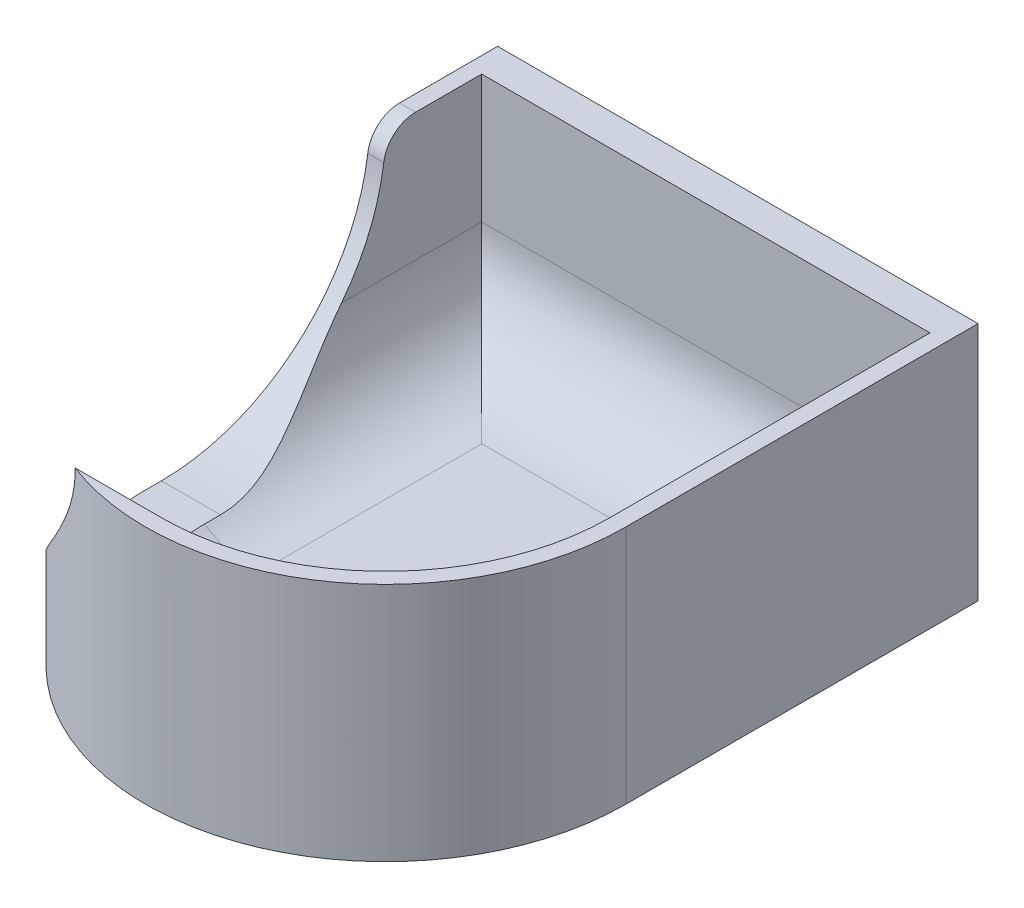
ISO-10303-21;
HEADER;
FILE_DESCRIPTION(('STEP AP214'),'2;1');
FILE_NAME('part.step','',(''),(''),'','','');
FILE_SCHEMA(('AUTOMOTIVE_DESIGN { 1 0 10303 214 1 1 1 1 }'));
ENDSEC;
DATA;
#1=APPLICATION_CONTEXT('core data for automotive mechanical design processes');
#2=APPLICATION_PROTOCOL_DEFINITION('international standard','automotive_design',2000,#1);
#3=PRODUCT_CONTEXT('',#1,'mechanical');
#4=PRODUCT('Part','Part','',(#3));
#5=PRODUCT_RELATED_PRODUCT_CATEGORY('part','',(#4));
#6=PRODUCT_DEFINITION_FORMATION('','',#4);
#7=PRODUCT_DEFINITION_CONTEXT('part definition',#1,'design');
#8=PRODUCT_DEFINITION('design','',#6,#7);
#9=PRODUCT_DEFINITION_SHAPE('','',#8);
#10=(LENGTH_UNIT() NAMED_UNIT(*) SI_UNIT(.MILLI.,.METRE.));
#11=(NAMED_UNIT(*) PLANE_ANGLE_UNIT() SI_UNIT($,.RADIAN.));
#12=(NAMED_UNIT(*) SI_UNIT($,.STERADIAN.) SOLID_ANGLE_UNIT());
#13=UNCERTAINTY_MEASURE_WITH_UNIT(LENGTH_MEASURE(1.E-05),#10,'distance_accuracy_value','');
#14=(GEOMETRIC_REPRESENTATION_CONTEXT(3) GLOBAL_UNCERTAINTY_ASSIGNED_CONTEXT((#13)) GLOBAL_UNIT_ASSIGNED_CONTEXT((#10,
#11,#12)) REPRESENTATION_CONTEXT('',''));
#15=CARTESIAN_POINT('',(0.,0.,0.));
#16=DIRECTION('',(0.,0.,1.));
#17=DIRECTION('',(1.,0.,0.));
#18=AXIS2_PLACEMENT_3D('',#15,#16,#17);
#19=CARTESIAN_POINT('',(0.,1.27,0.));
#20=DIRECTION('',(1.,0.,0.));
#21=DIRECTION('',(0.,0.,-1.));
#22=AXIS2_PLACEMENT_3D('',#19,#20,#21);
#23=PLANE('',#22);
#24=CARTESIAN_POINT('',(0.,19.05,24.13));
#25=DIRECTION('',(-1.,0.,0.));
#26=DIRECTION('',(0.,0.,1.));
#27=AXIS2_PLACEMENT_3D('',#24,#25,#26);
#28=CIRCLE('',#27,16.51);
#29=CARTESIAN_POINT('',(0.,16.8486666666667,7.76741366545142));
#30=VERTEX_POINT('',#29);
#31=CARTESIAN_POINT('',(0.,2.53999999999999,24.13));
#32=VERTEX_POINT('',#31);
#33=EDGE_CURVE('E370',#30,#32,#28,.T.);
#34=ORIENTED_EDGE('',*,*,#33,.F.);
#35=CARTESIAN_POINT('',(0.,16.51,5.25009269090549));
#36=DIRECTION('',(1.,0.,0.));
#37=DIRECTION('',(0.,0.,-1.));
#38=AXIS2_PLACEMENT_3D('',#35,#36,#37);
#39=CIRCLE('',#38,2.54);
#40=CARTESIAN_POINT('',(0.,19.05,5.25009269090549));
#41=VERTEX_POINT('',#40);
#42=EDGE_CURVE('E11',#30,#41,#39,.F.);
#43=ORIENTED_EDGE('',*,*,#42,.T.);
#44=DIRECTION('',(0.,0.,1.));
#45=VECTOR('',#44,1.);
#46=CARTESIAN_POINT('',(0.,19.05,0.));
#47=LINE('',#46,#45);
#48=CARTESIAN_POINT('',(0.,19.05,-2.54));
#49=VERTEX_POINT('',#48);
#50=EDGE_CURVE('E169',#49,#41,#47,.T.);
#51=ORIENTED_EDGE('',*,*,#50,.F.);
#52=DIRECTION('',(0.,1.,0.));
#53=VECTOR('',#52,1.);
#54=CARTESIAN_POINT('',(0.,19.05,-2.54));
#55=LINE('',#54,#53);
#56=CARTESIAN_POINT('',(0.,0.,-2.54));
#57=VERTEX_POINT('',#56);
#58=EDGE_CURVE('E256',#57,#49,#55,.T.);
#59=ORIENTED_EDGE('',*,*,#58,.F.);
#60=DIRECTION('',(0.,0.,1.));
#61=VECTOR('',#60,1.);
#62=CARTESIAN_POINT('',(0.,0.,0.));
#63=LINE('',#62,#61);
#64=CARTESIAN_POINT('',(0.,0.,25.4));
#65=VERTEX_POINT('',#64);
#66=EDGE_CURVE('E184',#57,#65,#63,.T.);
#67=ORIENTED_EDGE('',*,*,#66,.T.);
#68=DIRECTION('',(0.,-1.,0.));
#69=VECTOR('',#68,1.);
#70=CARTESIAN_POINT('',(0.,1.27,25.4));
#71=LINE('',#70,#69);
#72=CARTESIAN_POINT('',(0.,2.53999999999999,25.4));
#73=VERTEX_POINT('',#72);
#74=EDGE_CURVE('E192',#73,#65,#71,.T.);
#75=ORIENTED_EDGE('',*,*,#74,.F.);
#76=DIRECTION('',(0.,0.,1.));
#77=VECTOR('',#76,1.);
#78=CARTESIAN_POINT('',(0.,2.53999999999999,24.13));
#79=LINE('',#78,#77);
#80=EDGE_CURVE('E371',#32,#73,#79,.T.);
#81=ORIENTED_EDGE('',*,*,#80,.F.);
#82=EDGE_LOOP('',(#34,#43,#51,#59,#67,#75,#81));
#83=FACE_BOUND('',#82,.T.);
#84=ADVANCED_FACE('F33',(#83),#23,.F.);
#85=CARTESIAN_POINT('',(19.05,1.27,25.4));
#86=DIRECTION('',(0.,-1.,0.));
#87=DIRECTION('',(0.,0.,-1.));
#88=AXIS2_PLACEMENT_3D('',#85,#86,#87);
#89=CYLINDRICAL_SURFACE('',#88,19.05);
#90=CARTESIAN_POINT('',(0.0423804751883763,2.53999999999999,26.67));
#91=CARTESIAN_POINT('',(0.0556551029180689,2.539997343718,26.868723074491));
#92=CARTESIAN_POINT('',(0.0720511813743714,2.54358885050869,27.0672053878828));
#93=CARTESIAN_POINT('',(0.111021359827417,2.55787912838895,27.4632921775987));
#94=CARTESIAN_POINT('',(0.133595024486384,2.56857739873693,27.6608967147832));
#95=CARTESIAN_POINT('',(0.210430301954301,2.61117924349988,28.2513935083383));
#96=CARTESIAN_POINT('',(0.273836675767801,2.65359023105209,28.6424223614394));
#97=CARTESIAN_POINT('',(0.423305751570554,2.76478825043021,29.4126623917759));
#98=CARTESIAN_POINT('',(0.509169859931028,2.83334638492809,29.7919460782634));
#99=CARTESIAN_POINT('',(0.702362085916339,2.9953307867168,30.5396290604992));
#100=CARTESIAN_POINT('',(0.809694049303724,3.08876151069003,30.9080263924694));
#101=CARTESIAN_POINT('',(1.04366998107699,3.29832656471585,31.6304310171624));
#102=CARTESIAN_POINT('',(1.1702456452415,3.41438098920775,31.9844838070084));
#103=CARTESIAN_POINT('',(1.44111377925414,3.66750416048797,32.6779254389082));
#104=CARTESIAN_POINT('',(1.58540541126723,3.80457191357652,33.0173149734007));
#105=CARTESIAN_POINT('',(1.89014286455748,4.09815925358456,33.6810290739423));
#106=CARTESIAN_POINT('',(2.05062266550293,4.25471992531914,34.0053197717281));
#107=CARTESIAN_POINT('',(2.38562465049262,4.58527436726568,34.63737495908));
#108=CARTESIAN_POINT('',(2.56015005318496,4.75927213556355,34.9451356335798));
#109=CARTESIAN_POINT('',(3.00050158087159,5.20262815039843,35.6746563179186));
#110=CARTESIAN_POINT('',(3.27286885905098,5.48040451355319,36.087389638051));
#111=CARTESIAN_POINT('',(3.83782201503168,6.06413243501636,36.8772831521421));
#112=CARTESIAN_POINT('',(4.1304075120419,6.37008346271761,37.2544440157581));
#113=CARTESIAN_POINT('',(4.73176383540349,7.00731530409966,37.974214895681));
#114=CARTESIAN_POINT('',(5.04056133971244,7.33863830776129,38.3167650655728));
#115=CARTESIAN_POINT('',(5.66946842596214,8.02355775221394,38.9671834806088));
#116=CARTESIAN_POINT('',(5.98957618311975,8.37715060715146,39.2750572871344));
#117=CARTESIAN_POINT('',(6.64477461905551,9.11408194153044,39.8641527562994));
#118=CARTESIAN_POINT('',(6.98004008055035,9.49793942781883,40.1445282346122));
#119=CARTESIAN_POINT('',(7.65292722302761,10.2871127527016,40.6706075520662));
#120=CARTESIAN_POINT('',(7.99054967414581,10.6924359202691,40.9162994429539));
#121=CARTESIAN_POINT('',(8.49374978961491,11.3172035840868,41.2590478554189));
#122=CARTESIAN_POINT('',(8.66099098488786,11.5283185869105,41.3690264887104));
#123=CARTESIAN_POINT('',(8.99330911197168,11.9564718050915,41.5803647261186));
#124=CARTESIAN_POINT('',(9.15838624792917,12.1735094556958,41.6817251482559));
#125=CARTESIAN_POINT('',(9.48499606915872,12.6138432219316,41.8757171870623));
#126=CARTESIAN_POINT('',(9.64653076382745,12.8371356168773,41.9683538558357));
#127=CARTESIAN_POINT('',(9.96447524973992,13.290705538023,42.144813231693));
#128=CARTESIAN_POINT('',(10.1208859529102,13.5209818070862,42.2286375130654));
#129=CARTESIAN_POINT('',(10.4102363410239,13.964567852795,42.3788301093524));
#130=CARTESIAN_POINT('',(10.5439071855732,14.1770908724114,42.4461069282376));
#131=CARTESIAN_POINT('',(10.8033562577825,14.6091193977409,42.5731247682412));
#132=CARTESIAN_POINT('',(10.9291349238425,14.8286245145854,42.6328662081264));
#133=CARTESIAN_POINT('',(11.1691695253017,15.273672456814,42.7439430806485));
#134=CARTESIAN_POINT('',(11.2835068793378,15.4991556289124,42.7953398154261));
#135=CARTESIAN_POINT('',(11.498315641895,15.9584670231985,42.8896632479067));
#136=CARTESIAN_POINT('',(11.5987864786133,16.1922955890185,42.9325895963543));
#137=CARTESIAN_POINT('',(11.7689442324577,16.6358286177001,43.0038646754241));
#138=CARTESIAN_POINT('',(11.8409638530378,16.8444363931379,43.0334057624827));
#139=CARTESIAN_POINT('',(11.9681651684859,17.2674984981419,43.0848757169496));
#140=CARTESIAN_POINT('',(12.0233626141694,17.481947152551,43.1068117077708));
#141=CARTESIAN_POINT('',(12.1146771509398,17.9200758679871,43.1427816491988));
#142=CARTESIAN_POINT('',(12.150399709167,18.1438544566717,43.1566525596305));
#143=CARTESIAN_POINT('',(12.1864817242824,18.4820048081312,43.1706153137696));
#144=CARTESIAN_POINT('',(12.195592650614,18.5953540346697,43.1741290884134));
#145=CARTESIAN_POINT('',(12.2077807577258,18.8224598934582,43.17882325116));
#146=CARTESIAN_POINT('',(12.2108560021738,18.9362166447261,43.1800028904402));
#147=CARTESIAN_POINT('',(12.2108406949392,19.05,43.18));
#148=B_SPLINE_CURVE_WITH_KNOTS('',3,(#90,#91,#92,#93,#94,#95,#96,#97,#98,#99,#100,#101,#102,
#103,#104,#105,#106,#107,#108,#109,#110,#111,#112,#113,#114,#115,#116,#117,#118,#119,#120,#121,
#122,#123,#124,#125,#126,#127,#128,#129,#130,#131,#132,#133,#134,#135,#136,#137,#138,#139,#140,
#141,#142,#143,#144,#145,#146,#147),.UNSPECIFIED.,.F.,.F.,(4,2,2,2,2,2,2,2,2,2,2,2,2,2,2,2,2,2,
2,2,2,2,2,2,2,2,2,2,4),(0.,0.597378441710434,1.19471479668098,2.388029717813,3.57112938842866,
4.7544411902553,5.93364694788354,7.11279695921495,8.29447570247735,9.476426011002,
11.1754345355077,12.8744110695065,14.5762768109188,16.277869217949,18.0214928126942,
19.7657156153694,20.6383197762293,21.510841018849,22.382853818505,23.2547105718267,
24.0342101807137,24.8136664510397,25.5871086248445,26.3605826829546,27.0278402960792,
27.6944712142999,28.3741478024441,28.7152906512354,29.0565429255916),.UNSPECIFIED.);
#149=CARTESIAN_POINT('',(0.0423804751883763,2.53999999999999,26.67));
#150=VERTEX_POINT('',#149);
#151=CARTESIAN_POINT('',(12.2108406949392,19.05,43.18));
#152=VERTEX_POINT('',#151);
#153=EDGE_CURVE('E142',#150,#152,#148,.T.);
#154=ORIENTED_EDGE('',*,*,#153,.F.);
#155=CARTESIAN_POINT('',(19.05,2.53999999999999,25.4));
#156=DIRECTION('',(0.,-1.,0.));
#157=DIRECTION('',(0.,0.,-1.));
#158=AXIS2_PLACEMENT_3D('',#155,#156,#157);
#159=CIRCLE('',#158,19.05);
#160=EDGE_CURVE('E153',#73,#150,#159,.F.);
#161=ORIENTED_EDGE('',*,*,#160,.F.);
#162=ORIENTED_EDGE('',*,*,#74,.T.);
#163=CARTESIAN_POINT('',(19.05,0.,25.4));
#164=DIRECTION('',(0.,1.,0.));
#165=DIRECTION('',(0.,0.,1.));
#166=AXIS2_PLACEMENT_3D('',#163,#164,#165);
#167=CIRCLE('',#166,19.05);
#168=CARTESIAN_POINT('',(38.1,0.,25.4));
#169=VERTEX_POINT('',#168);
#170=EDGE_CURVE('E187',#65,#169,#167,.T.);
#171=ORIENTED_EDGE('',*,*,#170,.T.);
#172=DIRECTION('',(0.,-1.,0.));
#173=VECTOR('',#172,1.);
#174=CARTESIAN_POINT('',(38.1,1.27,25.4));
#175=LINE('',#174,#173);
#176=CARTESIAN_POINT('',(38.1,19.05,25.4));
#177=VERTEX_POINT('',#176);
#178=EDGE_CURVE('E166',#177,#169,#175,.T.);
#179=ORIENTED_EDGE('',*,*,#178,.F.);
#180=CARTESIAN_POINT('',(19.05,19.05,25.4));
#181=DIRECTION('',(0.,1.,0.));
#182=DIRECTION('',(0.,0.,1.));
#183=AXIS2_PLACEMENT_3D('',#180,#181,#182);
#184=CIRCLE('',#183,19.05);
#185=EDGE_CURVE('E159',#152,#177,#184,.T.);
#186=ORIENTED_EDGE('',*,*,#185,.F.);
#187=EDGE_LOOP('',(#154,#161,#162,#171,#179,#186));
#188=FACE_BOUND('',#187,.T.);
#189=ADVANCED_FACE('F164',(#188),#89,.T.);
#190=CARTESIAN_POINT('',(38.1,1.27,0.));
#191=DIRECTION('',(-1.,0.,0.));
#192=DIRECTION('',(0.,0.,1.));
#193=AXIS2_PLACEMENT_3D('',#190,#191,#192);
#194=PLANE('',#193);
#195=DIRECTION('',(0.,0.,-1.));
#196=VECTOR('',#195,1.);
#197=CARTESIAN_POINT('',(38.1,0.,0.));
#198=LINE('',#197,#196);
#199=CARTESIAN_POINT('',(38.1,0.,-2.54));
#200=VERTEX_POINT('',#199);
#201=EDGE_CURVE('E189',#169,#200,#198,.T.);
#202=ORIENTED_EDGE('',*,*,#201,.T.);
#203=DIRECTION('',(0.,-1.,0.));
#204=VECTOR('',#203,1.);
#205=CARTESIAN_POINT('',(38.1,19.05,-2.54));
#206=LINE('',#205,#204);
#207=CARTESIAN_POINT('',(38.1,19.05,-2.54));
#208=VERTEX_POINT('',#207);
#209=EDGE_CURVE('E245',#208,#200,#206,.T.);
#210=ORIENTED_EDGE('',*,*,#209,.F.);
#211=DIRECTION('',(0.,0.,-1.));
#212=VECTOR('',#211,1.);
#213=CARTESIAN_POINT('',(38.1,19.05,25.4));
#214=LINE('',#213,#212);
#215=EDGE_CURVE('E168',#177,#208,#214,.T.);
#216=ORIENTED_EDGE('',*,*,#215,.F.);
#217=ORIENTED_EDGE('',*,*,#178,.T.);
#218=EDGE_LOOP('',(#202,#210,#216,#217));
#219=FACE_BOUND('',#218,.T.);
#220=ADVANCED_FACE('F329',(#219),#194,.F.);
#221=CARTESIAN_POINT('',(19.05,1.27,25.4));
#222=DIRECTION('',(0.,1.,0.));
#223=DIRECTION('',(0.,0.,1.));
#224=AXIS2_PLACEMENT_3D('',#221,#222,#223);
#225=PLANE('',#224);
#226=DIRECTION('',(0.,0.,1.));
#227=VECTOR('',#226,1.);
#228=CARTESIAN_POINT('',(29.21,1.27,25.4));
#229=LINE('',#228,#227);
#230=CARTESIAN_POINT('',(29.21,1.27,25.4));
#231=VERTEX_POINT('',#230);
#232=CARTESIAN_POINT('',(29.21,1.27,7.62));
#233=VERTEX_POINT('',#232);
#234=EDGE_CURVE('E360',#231,#233,#229,.F.);
#235=ORIENTED_EDGE('',*,*,#234,.T.);
#236=DIRECTION('',(-1.,0.,0.));
#237=VECTOR('',#236,1.);
#238=CARTESIAN_POINT('',(19.05,1.27,7.62));
#239=LINE('',#238,#237);
#240=CARTESIAN_POINT('',(8.89,1.27,7.62));
#241=VERTEX_POINT('',#240);
#242=EDGE_CURVE('E361',#233,#241,#239,.T.);
#243=ORIENTED_EDGE('',*,*,#242,.T.);
#244=DIRECTION('',(0.,0.,-1.));
#245=VECTOR('',#244,1.);
#246=CARTESIAN_POINT('',(8.89,1.27,25.4));
#247=LINE('',#246,#245);
#248=CARTESIAN_POINT('',(8.89,1.27,25.4));
#249=VERTEX_POINT('',#248);
#250=EDGE_CURVE('E194',#241,#249,#247,.F.);
#251=ORIENTED_EDGE('',*,*,#250,.T.);
#252=CARTESIAN_POINT('',(19.05,1.27,25.4));
#253=DIRECTION('',(0.,1.,0.));
#254=DIRECTION('',(0.,0.,1.));
#255=AXIS2_PLACEMENT_3D('',#252,#253,#254);
#256=CIRCLE('',#255,10.16);
#257=EDGE_CURVE('E358',#249,#231,#256,.T.);
#258=ORIENTED_EDGE('',*,*,#257,.T.);
#259=EDGE_LOOP('',(#235,#243,#251,#258));
#260=FACE_BOUND('',#259,.T.);
#261=ADVANCED_FACE('F326',(#260),#225,.T.);
#262=CARTESIAN_POINT('',(19.05,0.,25.4));
#263=DIRECTION('',(0.,1.,0.));
#264=DIRECTION('',(0.,0.,1.));
#265=AXIS2_PLACEMENT_3D('',#262,#263,#264);
#266=PLANE('',#265);
#267=ORIENTED_EDGE('',*,*,#66,.F.);
#268=DIRECTION('',(-1.,0.,0.));
#269=VECTOR('',#268,1.);
#270=CARTESIAN_POINT('',(38.1,0.,-2.54));
#271=LINE('',#270,#269);
#272=EDGE_CURVE('E249',#200,#57,#271,.T.);
#273=ORIENTED_EDGE('',*,*,#272,.F.);
#274=ORIENTED_EDGE('',*,*,#201,.F.);
#275=ORIENTED_EDGE('',*,*,#170,.F.);
#276=EDGE_LOOP('',(#267,#273,#274,#275));
#277=FACE_BOUND('',#276,.T.);
#278=ADVANCED_FACE('F324',(#277),#266,.F.);
#279=CARTESIAN_POINT('',(36.83,19.05,0.));
#280=DIRECTION('',(1.,0.,0.));
#281=DIRECTION('',(0.,0.,-1.));
#282=AXIS2_PLACEMENT_3D('',#279,#280,#281);
#283=PLANE('',#282);
#284=DIRECTION('',(0.,-1.,0.));
#285=VECTOR('',#284,1.);
#286=CARTESIAN_POINT('',(36.83,19.05,0.));
#287=LINE('',#286,#285);
#288=CARTESIAN_POINT('',(36.83,19.05,0.));
#289=VERTEX_POINT('',#288);
#290=CARTESIAN_POINT('',(36.83,8.89,0.));
#291=VERTEX_POINT('',#290);
#292=EDGE_CURVE('E182',#289,#291,#287,.T.);
#293=ORIENTED_EDGE('',*,*,#292,.T.);
#294=DIRECTION('',(0.,0.,1.));
#295=VECTOR('',#294,1.);
#296=CARTESIAN_POINT('',(36.83,8.89,0.));
#297=LINE('',#296,#295);
#298=CARTESIAN_POINT('',(36.83,8.89,25.4));
#299=VERTEX_POINT('',#298);
#300=EDGE_CURVE('E224',#291,#299,#297,.T.);
#301=ORIENTED_EDGE('',*,*,#300,.T.);
#302=DIRECTION('',(0.,-1.,0.));
#303=VECTOR('',#302,1.);
#304=CARTESIAN_POINT('',(36.83,19.05,25.4));
#305=LINE('',#304,#303);
#306=CARTESIAN_POINT('',(36.83,19.05,25.4));
#307=VERTEX_POINT('',#306);
#308=EDGE_CURVE('E179',#307,#299,#305,.T.);
#309=ORIENTED_EDGE('',*,*,#308,.F.);
#310=DIRECTION('',(0.,0.,1.));
#311=VECTOR('',#310,1.);
#312=CARTESIAN_POINT('',(36.83,19.05,0.));
#313=LINE('',#312,#311);
#314=EDGE_CURVE('E171',#289,#307,#313,.T.);
#315=ORIENTED_EDGE('',*,*,#314,.F.);
#316=EDGE_LOOP('',(#293,#301,#309,#315));
#317=FACE_BOUND('',#316,.T.);
#318=ADVANCED_FACE('F320',(#317),#283,.F.);
#319=CARTESIAN_POINT('',(19.05,19.05,25.4));
#320=DIRECTION('',(0.,-1.,0.));
#321=DIRECTION('',(0.,0.,-1.));
#322=AXIS2_PLACEMENT_3D('',#319,#320,#321);
#323=CYLINDRICAL_SURFACE('',#322,17.78);
#324=CARTESIAN_POINT('',(19.05,8.89,25.4));
#325=DIRECTION('',(0.,1.,0.));
#326=DIRECTION('',(0.,0.,1.));
#327=AXIS2_PLACEMENT_3D('',#324,#325,#326);
#328=CIRCLE('',#327,17.78);
#329=CARTESIAN_POINT('',(8.46196967235325,8.89,39.6836274727687));
#330=VERTEX_POINT('',#329);
#331=EDGE_CURVE('E219',#299,#330,#328,.F.);
#332=ORIENTED_EDGE('',*,*,#331,.T.);
#333=CARTESIAN_POINT('',(8.46196967235325,8.89,39.6836274727687));
#334=CARTESIAN_POINT('',(8.68530876541504,9.1020547441119,39.849172674323));
#335=CARTESIAN_POINT('',(8.91095064161583,9.31658307025659,40.0083281410843));
#336=CARTESIAN_POINT('',(9.36635673715928,9.75006889500698,40.3141117517929));
#337=CARTESIAN_POINT('',(9.5961203476241,9.96902574001477,40.4607417279102));
#338=CARTESIAN_POINT('',(10.2905953093621,10.6315007608812,40.8820650563732));
#339=CARTESIAN_POINT('',(10.7608519798848,11.0809665532606,41.1384575508911));
#340=CARTESIAN_POINT('',(11.7117945706679,11.9912133524205,41.6036686284633));
#341=CARTESIAN_POINT('',(12.1924609454968,12.4519733368379,41.8125691163161));
#342=CARTESIAN_POINT('',(13.1624156400652,13.382759453983,42.1849523146268));
#343=CARTESIAN_POINT('',(13.6517048595649,13.8527865543128,42.348430255221));
#344=CARTESIAN_POINT('',(14.5461024573266,14.7126271342244,42.6051792341021));
#345=CARTESIAN_POINT('',(14.9501793819951,15.1013298772043,42.7058289078576));
#346=CARTESIAN_POINT('',(15.7613678233381,15.8820004362566,42.8781381650228));
#347=CARTESIAN_POINT('',(16.1684798946605,16.273968850722,42.9497923105826));
#348=CARTESIAN_POINT('',(17.3920195128562,17.4523319331716,43.1216616105605));
#349=CARTESIAN_POINT('',(18.2117843342853,18.2422751884191,43.1791053011577));
#350=CARTESIAN_POINT('',(19.0371977835555,19.0376634756445,43.1799965412986));
#351=CARTESIAN_POINT('',(19.0435989160056,19.043831761217,43.1799999980066));
#352=CARTESIAN_POINT('',(19.05,19.05,43.18));
#353=B_SPLINE_CURVE_WITH_KNOTS('',3,(#333,#334,#335,#336,#337,#338,#339,#340,#341,#342,#343,
#344,#345,#346,#347,#348,#349,#350,#351,#352),.UNSPECIFIED.,.F.,.F.,(4,2,2,2,2,2,2,2,2,4),(0.,
1.04876968974704,2.09738570674164,4.19292847807109,6.28482938411923,8.37694987966886,
10.0850967706223,11.7935638608301,15.2057002548419,15.2323685901395),.UNSPECIFIED.);
#354=CARTESIAN_POINT('',(19.05,19.05,43.18));
#355=VERTEX_POINT('',#354);
#356=EDGE_CURVE('E262',#355,#330,#353,.F.);
#357=ORIENTED_EDGE('',*,*,#356,.F.);
#358=CARTESIAN_POINT('',(19.05,19.05,25.4));
#359=DIRECTION('',(0.,-1.,0.));
#360=DIRECTION('',(0.,0.,1.));
#361=AXIS2_PLACEMENT_3D('',#358,#359,#360);
#362=CIRCLE('',#361,17.78);
#363=EDGE_CURVE('E162',#307,#355,#362,.T.);
#364=ORIENTED_EDGE('',*,*,#363,.F.);
#365=ORIENTED_EDGE('',*,*,#308,.T.);
#366=EDGE_LOOP('',(#332,#357,#364,#365));
#367=FACE_BOUND('',#366,.T.);
#368=ADVANCED_FACE('F317',(#367),#323,.F.);
#369=CARTESIAN_POINT('',(1.27,19.05,0.));
#370=DIRECTION('',(-1.,0.,0.));
#371=DIRECTION('',(0.,0.,1.));
#372=AXIS2_PLACEMENT_3D('',#369,#370,#371);
#373=PLANE('',#372);
#374=DIRECTION('',(0.,0.,-1.));
#375=VECTOR('',#374,1.);
#376=CARTESIAN_POINT('',(1.27,19.05,0.));
#377=LINE('',#376,#375);
#378=CARTESIAN_POINT('',(1.27,19.05,5.25009269090549));
#379=VERTEX_POINT('',#378);
#380=CARTESIAN_POINT('',(1.27000000000003,19.05,0.));
#381=VERTEX_POINT('',#380);
#382=EDGE_CURVE('E178',#379,#381,#377,.T.);
#383=ORIENTED_EDGE('',*,*,#382,.F.);
#384=CARTESIAN_POINT('',(1.27,16.51,5.25009269090549));
#385=DIRECTION('',(-1.,0.,0.));
#386=DIRECTION('',(0.,0.,1.));
#387=AXIS2_PLACEMENT_3D('',#384,#385,#386);
#388=CIRCLE('',#387,2.54);
#389=CARTESIAN_POINT('',(1.27,16.8486666666667,7.76741366545142));
#390=VERTEX_POINT('',#389);
#391=EDGE_CURVE('E55',#379,#390,#388,.F.);
#392=ORIENTED_EDGE('',*,*,#391,.T.);
#393=CARTESIAN_POINT('',(1.27,19.05,24.13));
#394=DIRECTION('',(-1.,0.,0.));
#395=DIRECTION('',(0.,0.,1.));
#396=AXIS2_PLACEMENT_3D('',#393,#394,#395);
#397=CIRCLE('',#396,16.51);
#398=CARTESIAN_POINT('',(1.27,8.89,11.1163725272313));
#399=VERTEX_POINT('',#398);
#400=EDGE_CURVE('E231',#399,#390,#397,.F.);
#401=ORIENTED_EDGE('',*,*,#400,.F.);
#402=DIRECTION('',(0.,0.,-1.));
#403=VECTOR('',#402,1.);
#404=CARTESIAN_POINT('',(1.27,8.89,0.));
#405=LINE('',#404,#403);
#406=CARTESIAN_POINT('',(1.27,8.89,0.));
#407=VERTEX_POINT('',#406);
#408=EDGE_CURVE('E217',#399,#407,#405,.T.);
#409=ORIENTED_EDGE('',*,*,#408,.T.);
#410=DIRECTION('',(0.,-1.,0.));
#411=VECTOR('',#410,1.);
#412=CARTESIAN_POINT('',(1.27,19.05,0.));
#413=LINE('',#412,#411);
#414=EDGE_CURVE('E183',#381,#407,#413,.T.);
#415=ORIENTED_EDGE('',*,*,#414,.F.);
#416=EDGE_LOOP('',(#383,#392,#401,#409,#415));
#417=FACE_BOUND('',#416,.T.);
#418=ADVANCED_FACE('F314',(#417),#373,.F.);
#419=CARTESIAN_POINT('',(19.05,19.05,25.4));
#420=DIRECTION('',(0.,1.,0.));
#421=DIRECTION('',(0.,0.,1.));
#422=AXIS2_PLACEMENT_3D('',#419,#420,#421);
#423=PLANE('',#422);
#424=ORIENTED_EDGE('',*,*,#50,.T.);
#425=DIRECTION('',(1.,0.,0.));
#426=VECTOR('',#425,1.);
#427=CARTESIAN_POINT('',(1.27,19.05,5.25009269090549));
#428=LINE('',#427,#426);
#429=EDGE_CURVE('E214',#41,#379,#428,.T.);
#430=ORIENTED_EDGE('',*,*,#429,.T.);
#431=ORIENTED_EDGE('',*,*,#382,.T.);
#432=DIRECTION('',(1.,0.,0.));
#433=VECTOR('',#432,1.);
#434=CARTESIAN_POINT('',(38.1,19.05,0.));
#435=LINE('',#434,#433);
#436=EDGE_CURVE('E239',#381,#289,#435,.T.);
#437=ORIENTED_EDGE('',*,*,#436,.T.);
#438=ORIENTED_EDGE('',*,*,#314,.T.);
#439=ORIENTED_EDGE('',*,*,#363,.T.);
#440=DIRECTION('',(-1.,0.,0.));
#441=VECTOR('',#440,1.);
#442=CARTESIAN_POINT('',(38.101,19.05,43.18));
#443=LINE('',#442,#441);
#444=EDGE_CURVE('E145',#355,#152,#443,.T.);
#445=ORIENTED_EDGE('',*,*,#444,.T.);
#446=ORIENTED_EDGE('',*,*,#185,.T.);
#447=ORIENTED_EDGE('',*,*,#215,.T.);
#448=DIRECTION('',(1.,0.,0.));
#449=VECTOR('',#448,1.);
#450=CARTESIAN_POINT('',(38.1,19.05,-2.54));
#451=LINE('',#450,#449);
#452=EDGE_CURVE('E173',#49,#208,#451,.T.);
#453=ORIENTED_EDGE('',*,*,#452,.F.);
#454=EDGE_LOOP('',(#424,#430,#431,#437,#438,#439,#445,#446,#447,#453));
#455=FACE_BOUND('',#454,.T.);
#456=ADVANCED_FACE('F158',(#455),#423,.T.);
#457=CARTESIAN_POINT('',(0.,0.,0.));
#458=DIRECTION('',(0.,0.,-1.));
#459=DIRECTION('',(-1.,0.,0.));
#460=AXIS2_PLACEMENT_3D('',#457,#458,#459);
#461=PLANE('',#460);
#462=ORIENTED_EDGE('',*,*,#414,.T.);
#463=DIRECTION('',(-1.,0.,0.));
#464=VECTOR('',#463,1.);
#465=CARTESIAN_POINT('',(0.,8.89,0.));
#466=LINE('',#465,#464);
#467=EDGE_CURVE('E366',#407,#291,#466,.F.);
#468=ORIENTED_EDGE('',*,*,#467,.T.);
#469=ORIENTED_EDGE('',*,*,#292,.F.);
#470=ORIENTED_EDGE('',*,*,#436,.F.);
#471=EDGE_LOOP('',(#462,#468,#469,#470));
#472=FACE_BOUND('',#471,.T.);
#473=ADVANCED_FACE('F307',(#472),#461,.F.);
#474=CARTESIAN_POINT('',(0.,0.,-2.54));
#475=DIRECTION('',(0.,0.,-1.));
#476=DIRECTION('',(-1.,0.,0.));
#477=AXIS2_PLACEMENT_3D('',#474,#475,#476);
#478=PLANE('',#477);
#479=ORIENTED_EDGE('',*,*,#209,.T.);
#480=ORIENTED_EDGE('',*,*,#272,.T.);
#481=ORIENTED_EDGE('',*,*,#58,.T.);
#482=ORIENTED_EDGE('',*,*,#452,.T.);
#483=EDGE_LOOP('',(#479,#480,#481,#482));
#484=FACE_BOUND('',#483,.T.);
#485=ADVANCED_FACE('F303',(#484),#478,.T.);
#486=CARTESIAN_POINT('',(19.05,8.89,25.4));
#487=DIRECTION('',(0.,1.,0.));
#488=DIRECTION('',(0.,0.,1.));
#489=AXIS2_PLACEMENT_3D('',#486,#487,#488);
#490=TOROIDAL_SURFACE('',#489,10.16,7.62);
#491=CARTESIAN_POINT('',(8.89000000000001,8.89,25.4));
#492=DIRECTION('',(0.,0.,1.));
#493=DIRECTION('',(1.,0.,0.));
#494=AXIS2_PLACEMENT_3D('',#491,#492,#493);
#495=CIRCLE('',#494,7.62);
#496=CARTESIAN_POINT('',(4.67788651624866,2.54,25.4));
#497=VERTEX_POINT('',#496);
#498=EDGE_CURVE('E232',#497,#249,#495,.T.);
#499=ORIENTED_EDGE('',*,*,#498,.F.);
#500=CARTESIAN_POINT('',(19.05,2.53999999999999,25.4));
#501=DIRECTION('',(0.,-1.,0.));
#502=DIRECTION('',(0.,0.,-1.));
#503=AXIS2_PLACEMENT_3D('',#500,#501,#502);
#504=CIRCLE('',#503,14.3721134837513);
#505=CARTESIAN_POINT('',(4.73410862049355,2.53999999999999,26.67));
#506=VERTEX_POINT('',#505);
#507=EDGE_CURVE('E269',#506,#497,#504,.T.);
#508=ORIENTED_EDGE('',*,*,#507,.F.);
#509=CARTESIAN_POINT('',(8.46218032046601,8.8902,39.6837836143068));
#510=CARTESIAN_POINT('',(8.35863565716261,8.79189370963648,39.6070376729059));
#511=CARTESIAN_POINT('',(8.25750228103449,8.69290050608588,39.5279593648404));
#512=CARTESIAN_POINT('',(8.06011801149848,8.49391612476038,39.3651062314791));
#513=CARTESIAN_POINT('',(7.96386709213949,8.39392495229323,39.2813314311509));
#514=CARTESIAN_POINT('',(7.68260784047349,8.09310391847125,39.0229882822305));
#515=CARTESIAN_POINT('',(7.50500284736511,7.89134037820196,38.8413344843532));
#516=CARTESIAN_POINT('',(7.17056728540755,7.48934688530989,38.4601602426911));
#517=CARTESIAN_POINT('',(7.01366713836496,7.2891140431531,38.2607036208956));
#518=CARTESIAN_POINT('',(6.7198592063581,6.8925179061422,37.8440074429548));
#519=CARTESIAN_POINT('',(6.58295133713121,6.69615459498197,37.626767961766));
#520=CARTESIAN_POINT('',(6.32790819676709,6.3088726202001,37.1739576769521));
#521=CARTESIAN_POINT('',(6.20990577962251,6.11799961592515,36.9382731087421));
#522=CARTESIAN_POINT('',(5.9930744980482,5.74573567999499,36.4511362186566));
#523=CARTESIAN_POINT('',(5.89424600352141,5.56434493132057,36.1996835927079));
#524=CARTESIAN_POINT('',(5.71473816182248,5.2134245884565,35.682595706104));
#525=CARTESIAN_POINT('',(5.63405247099022,5.0438908627694,35.4169654430052));
#526=CARTESIAN_POINT('',(5.48938061098586,4.71856097747802,34.8730718517851));
#527=CARTESIAN_POINT('',(5.42539473736211,4.56276506103367,34.594808300186));
#528=CARTESIAN_POINT('',(5.30890729229673,4.25744462126285,34.0100094037919));
#529=CARTESIAN_POINT('',(5.25734500175953,4.10888321748203,33.702785088973));
#530=CARTESIAN_POINT('',(5.16844364627926,3.83045465616416,33.078005814212));
#531=CARTESIAN_POINT('',(5.13110538068032,3.7005885494973,32.7604502747766));
#532=CARTESIAN_POINT('',(5.06746599729206,3.46039832667328,32.1163546267551));
#533=CARTESIAN_POINT('',(5.04118421356922,3.35010863609676,31.7897998348901));
#534=CARTESIAN_POINT('',(4.99604230306998,3.15007598934841,31.1299740817611));
#535=CARTESIAN_POINT('',(4.97718223891432,3.06033320654374,30.796703063854));
#536=CARTESIAN_POINT('',(4.9439794621683,2.90774866689366,30.1499312770548));
#537=CARTESIAN_POINT('',(4.92940567340949,2.84340711426381,29.8367936991251));
#538=CARTESIAN_POINT('',(4.89957196017238,2.73301513504453,29.2073530646576));
#539=CARTESIAN_POINT('',(4.88431211787284,2.68696252418253,28.8910503907603));
#540=CARTESIAN_POINT('',(4.85862154723667,2.63178017783903,28.4157114859278));
#541=CARTESIAN_POINT('',(4.84960810575233,2.61571702010127,28.2573753373685));
#542=CARTESIAN_POINT('',(4.83035213122639,2.58817887387841,27.9403745897573));
#543=CARTESIAN_POINT('',(4.82010960759501,2.57670385026803,27.7817099932292));
#544=CARTESIAN_POINT('',(4.79816060394086,2.55834452802713,27.4641663356404));
#545=CARTESIAN_POINT('',(4.7864536587761,2.55146169242544,27.3052872223751));
#546=CARTESIAN_POINT('',(4.76147328196052,2.54228785600101,26.9875145035603));
#547=CARTESIAN_POINT('',(4.74819979920921,2.53999700501283,26.8286208977071));
#548=CARTESIAN_POINT('',(4.73409087754572,2.54000000121138,26.6698000000001));
#549=B_SPLINE_CURVE_WITH_KNOTS('',3,(#509,#510,#511,#512,#513,#514,#515,#516,#517,#518,#519,
#520,#521,#522,#523,#524,#525,#526,#527,#528,#529,#530,#531,#532,#533,#534,#535,#536,#537,#538,
#539,#540,#541,#542,#543,#544,#545,#546,#547,#548),.UNSPECIFIED.,.F.,.F.,(4,2,2,2,2,2,2,2,2,2,2,
2,2,2,2,2,2,2,2,4),(0.,0.486217168766472,0.972431752933074,1.9444379971298,2.91308980678779,
3.88173753369473,4.85691898642912,5.83211925047448,6.80697800213617,7.78185400538576,
8.81623014003079,9.8506643946918,10.8869000826339,11.9231445136243,12.8826648952181,
13.8420706455323,14.320224278921,14.7983742516499,15.2766764859106,15.7549943267191),.UNSPECIFIED.);
#550=EDGE_CURVE('E295',#330,#506,#549,.T.);
#551=ORIENTED_EDGE('',*,*,#550,.F.);
#552=ORIENTED_EDGE('',*,*,#331,.F.);
#553=CARTESIAN_POINT('',(29.21,8.89,25.4));
#554=DIRECTION('',(0.,0.,1.));
#555=DIRECTION('',(1.,0.,0.));
#556=AXIS2_PLACEMENT_3D('',#553,#554,#555);
#557=CIRCLE('',#556,7.62);
#558=EDGE_CURVE('E212',#231,#299,#557,.T.);
#559=ORIENTED_EDGE('',*,*,#558,.F.);
#560=ORIENTED_EDGE('',*,*,#257,.F.);
#561=EDGE_LOOP('',(#499,#508,#551,#552,#559,#560));
#562=FACE_BOUND('',#561,.T.);
#563=ADVANCED_FACE('F306',(#562),#490,.F.);
#564=CARTESIAN_POINT('',(29.21,8.89,0.));
#565=DIRECTION('',(0.,0.,1.));
#566=DIRECTION('',(1.,0.,0.));
#567=AXIS2_PLACEMENT_3D('',#564,#565,#566);
#568=CYLINDRICAL_SURFACE('',#567,7.62);
#569=ORIENTED_EDGE('',*,*,#558,.T.);
#570=ORIENTED_EDGE('',*,*,#300,.F.);
#571=CARTESIAN_POINT('',(29.21,8.89,7.62));
#572=DIRECTION('',(-0.707106781186547,0.,-0.707106781186547));
#573=DIRECTION('',(-0.707106781186547,0.,0.707106781186547));
#574=AXIS2_PLACEMENT_3D('',#571,#572,#573);
#575=ELLIPSE('',#574,10.776307345283,7.62);
#576=EDGE_CURVE('E230',#233,#291,#575,.F.);
#577=ORIENTED_EDGE('',*,*,#576,.F.);
#578=ORIENTED_EDGE('',*,*,#234,.F.);
#579=EDGE_LOOP('',(#569,#570,#577,#578));
#580=FACE_BOUND('',#579,.T.);
#581=ADVANCED_FACE('F349',(#580),#568,.F.);
#582=CARTESIAN_POINT('',(8.89,8.89,0.));
#583=DIRECTION('',(0.,0.,-1.));
#584=DIRECTION('',(-1.,0.,0.));
#585=AXIS2_PLACEMENT_3D('',#582,#583,#584);
#586=CYLINDRICAL_SURFACE('',#585,7.62);
#587=CARTESIAN_POINT('',(4.67788651624866,2.53999999999999,24.13));
#588=CARTESIAN_POINT('',(4.67792524825176,2.53999291657668,23.9660295945209));
#589=CARTESIAN_POINT('',(4.67420486825084,2.54244246817127,23.8020729034976));
#590=CARTESIAN_POINT('',(4.65953550963048,2.55219989588189,23.4746838048028));
#591=CARTESIAN_POINT('',(4.64858907380234,2.55950606300005,23.3112512330193));
#592=CARTESIAN_POINT('',(4.61980673756954,2.57888825319686,22.9858552528525));
#593=CARTESIAN_POINT('',(4.60199480878907,2.59094768301013,22.8238887175661));
#594=CARTESIAN_POINT('',(4.55999839982335,2.61974211447393,22.5012050821718));
#595=CARTESIAN_POINT('',(4.53581341484584,2.63647748649932,22.3404880820747));
#596=CARTESIAN_POINT('',(4.45516511344012,2.69315019658056,21.8639060517596));
#597=CARTESIAN_POINT('',(4.3902845057162,2.73976028982015,21.5502239272368));
#598=CARTESIAN_POINT('',(4.24329497801565,2.85005547719132,20.9297828652208));
#599=CARTESIAN_POINT('',(4.16116788436451,2.91375860311962,20.6230316119055));
#600=CARTESIAN_POINT('',(4.0065836873775,3.03987035495473,20.0913024091464));
#601=CARTESIAN_POINT('',(3.93669633133844,3.09876333524225,19.8647234154315));
#602=CARTESIAN_POINT('',(3.79206998932893,3.22565717128786,19.4156915243749));
#603=CARTESIAN_POINT('',(3.71733040353596,3.29365915419087,19.1932391415431));
#604=CARTESIAN_POINT('',(3.48847473021679,3.51114405725695,18.5318150795611));
#605=CARTESIAN_POINT('',(3.32973075892072,3.67409890675549,18.0988059122227));
#606=CARTESIAN_POINT('',(3.01064170659846,4.03651554389186,17.245867828372));
#607=CARTESIAN_POINT('',(2.85029263644792,4.23617643901299,16.8260256261445));
#608=CARTESIAN_POINT('',(2.53848067214438,4.67167043552691,16.0022344819552));
#609=CARTESIAN_POINT('',(2.38701314803706,4.90748445430278,15.5982772959612));
#610=CARTESIAN_POINT('',(2.14019801114555,5.34740388185147,14.9138733955889));
#611=CARTESIAN_POINT('',(2.04071200663248,5.54298446305233,14.6294239483329));
#612=CARTESIAN_POINT('',(1.85476420730836,5.9538953539389,14.0705556906819));
#613=CARTESIAN_POINT('',(1.76830405365079,6.16922814675645,13.7961381475201));
#614=CARTESIAN_POINT('',(1.61265100958679,6.61826683487676,13.2601477159345));
#615=CARTESIAN_POINT('',(1.54336925457178,6.85186958596837,12.9985145949147));
#616=CARTESIAN_POINT('',(1.42559829174131,7.33773799171407,12.4883974631786));
#617=CARTESIAN_POINT('',(1.37709384126365,7.58998980517023,12.2399039307077));
#618=CARTESIAN_POINT('',(1.31828379042197,8.01724811449475,11.8454681166216));
#619=CARTESIAN_POINT('',(1.3005043716205,8.18709029250093,11.6950180416017));
#620=CARTESIAN_POINT('',(1.27635474052981,8.53361409833171,11.4005999901966));
#621=CARTESIAN_POINT('',(1.27000560200681,8.71030774689973,11.2566444628879));
#622=CARTESIAN_POINT('',(1.27,8.89,11.1163725272313));
#623=B_SPLINE_CURVE_WITH_KNOTS('',3,(#587,#588,#589,#590,#591,#592,#593,#594,#595,#596,#597,
#598,#599,#600,#601,#602,#603,#604,#605,#606,#607,#608,#609,#610,#611,#612,#613,#614,#615,#616,
#617,#618,#619,#620,#621,#622),.UNSPECIFIED.,.F.,.F.,(4,2,2,2,2,2,2,2,2,2,2,2,2,2,2,2,2,4),(0.,
0.491828376915017,0.983483775546795,1.4734378325919,1.96343070922136,2.9332342853293,
3.9040649772899,4.63674972586087,5.36952522049096,6.83517060906894,8.30901426821401,
9.78208265338756,10.8590395576116,11.9361320365589,13.007530628773,14.0781418689672,
14.7604713407966,15.44405752573),.UNSPECIFIED.);
#624=CARTESIAN_POINT('',(4.67788651624866,2.53999999999999,24.13));
#625=VERTEX_POINT('',#624);
#626=EDGE_CURVE('E152',#625,#399,#623,.T.);
#627=ORIENTED_EDGE('',*,*,#626,.F.);
#628=DIRECTION('',(0.,0.,-1.));
#629=VECTOR('',#628,1.);
#630=CARTESIAN_POINT('',(4.67788651624865,2.53999999999999,0.));
#631=LINE('',#630,#629);
#632=EDGE_CURVE('E377',#497,#625,#631,.T.);
#633=ORIENTED_EDGE('',*,*,#632,.F.);
#634=ORIENTED_EDGE('',*,*,#498,.T.);
#635=ORIENTED_EDGE('',*,*,#250,.F.);
#636=CARTESIAN_POINT('',(8.89,8.89,7.62));
#637=DIRECTION('',(-0.707106781186547,0.,0.707106781186548));
#638=DIRECTION('',(-0.707106781186548,0.,-0.707106781186547));
#639=AXIS2_PLACEMENT_3D('',#636,#637,#638);
#640=ELLIPSE('',#639,10.776307345283,7.62);
#641=EDGE_CURVE('E228',#407,#241,#640,.T.);
#642=ORIENTED_EDGE('',*,*,#641,.F.);
#643=ORIENTED_EDGE('',*,*,#408,.F.);
#644=EDGE_LOOP('',(#627,#633,#634,#635,#642,#643));
#645=FACE_BOUND('',#644,.T.);
#646=ADVANCED_FACE('F345',(#645),#586,.F.);
#647=CARTESIAN_POINT('',(19.05,8.89,7.62));
#648=DIRECTION('',(-1.,0.,0.));
#649=DIRECTION('',(0.,0.,1.));
#650=AXIS2_PLACEMENT_3D('',#647,#648,#649);
#651=CYLINDRICAL_SURFACE('',#650,7.62);
#652=ORIENTED_EDGE('',*,*,#576,.T.);
#653=ORIENTED_EDGE('',*,*,#467,.F.);
#654=ORIENTED_EDGE('',*,*,#641,.T.);
#655=ORIENTED_EDGE('',*,*,#242,.F.);
#656=EDGE_LOOP('',(#652,#653,#654,#655));
#657=FACE_BOUND('',#656,.T.);
#658=ADVANCED_FACE('F342',(#657),#651,.F.);
#659=CARTESIAN_POINT('',(38.101,2.53999999999999,24.13));
#660=DIRECTION('',(0.,-1.,0.));
#661=DIRECTION('',(0.,0.,-1.));
#662=AXIS2_PLACEMENT_3D('',#659,#660,#661);
#663=PLANE('',#662);
#664=ORIENTED_EDGE('',*,*,#160,.T.);
#665=DIRECTION('',(-1.,0.,0.));
#666=VECTOR('',#665,1.);
#667=CARTESIAN_POINT('',(38.101,2.53999999999999,26.67));
#668=LINE('',#667,#666);
#669=EDGE_CURVE('E148',#506,#150,#668,.T.);
#670=ORIENTED_EDGE('',*,*,#669,.F.);
#671=ORIENTED_EDGE('',*,*,#507,.T.);
#672=ORIENTED_EDGE('',*,*,#632,.T.);
#673=DIRECTION('',(-1.,0.,0.));
#674=VECTOR('',#673,1.);
#675=CARTESIAN_POINT('',(38.101,2.53999999999999,24.13));
#676=LINE('',#675,#674);
#677=EDGE_CURVE('E373',#625,#32,#676,.T.);
#678=ORIENTED_EDGE('',*,*,#677,.T.);
#679=ORIENTED_EDGE('',*,*,#80,.T.);
#680=EDGE_LOOP('',(#664,#670,#671,#672,#678,#679));
#681=FACE_BOUND('',#680,.T.);
#682=ADVANCED_FACE('F278',(#681),#663,.F.);
#683=CARTESIAN_POINT('',(38.101,19.05,26.67));
#684=DIRECTION('',(-1.,0.,0.));
#685=DIRECTION('',(0.,0.,1.));
#686=AXIS2_PLACEMENT_3D('',#683,#684,#685);
#687=CYLINDRICAL_SURFACE('',#686,16.51);
#688=ORIENTED_EDGE('',*,*,#153,.T.);
#689=ORIENTED_EDGE('',*,*,#444,.F.);
#690=ORIENTED_EDGE('',*,*,#356,.T.);
#691=ORIENTED_EDGE('',*,*,#550,.T.);
#692=ORIENTED_EDGE('',*,*,#669,.T.);
#693=EDGE_LOOP('',(#688,#689,#690,#691,#692));
#694=FACE_BOUND('',#693,.T.);
#695=ADVANCED_FACE('F144',(#694),#687,.F.);
#696=CARTESIAN_POINT('',(38.101,19.05,24.13));
#697=DIRECTION('',(-1.,0.,0.));
#698=DIRECTION('',(0.,0.,1.));
#699=AXIS2_PLACEMENT_3D('',#696,#697,#698);
#700=CYLINDRICAL_SURFACE('',#699,16.51);
#701=ORIENTED_EDGE('',*,*,#400,.T.);
#702=DIRECTION('',(-1.,0.,0.));
#703=VECTOR('',#702,1.);
#704=CARTESIAN_POINT('',(38.101,16.8486666666667,7.76741366545142));
#705=LINE('',#704,#703);
#706=EDGE_CURVE('E41',#390,#30,#705,.T.);
#707=ORIENTED_EDGE('',*,*,#706,.T.);
#708=ORIENTED_EDGE('',*,*,#33,.T.);
#709=ORIENTED_EDGE('',*,*,#677,.F.);
#710=ORIENTED_EDGE('',*,*,#626,.T.);
#711=EDGE_LOOP('',(#701,#707,#708,#709,#710));
#712=FACE_BOUND('',#711,.T.);
#713=ADVANCED_FACE('F277',(#712),#700,.F.);
#714=CARTESIAN_POINT('',(38.101,16.51,5.25009269090549));
#715=DIRECTION('',(-1.,0.,0.));
#716=DIRECTION('',(0.,0.,1.));
#717=AXIS2_PLACEMENT_3D('',#714,#715,#716);
#718=CYLINDRICAL_SURFACE('',#717,2.54);
#719=ORIENTED_EDGE('',*,*,#42,.F.);
#720=ORIENTED_EDGE('',*,*,#706,.F.);
#721=ORIENTED_EDGE('',*,*,#391,.F.);
#722=ORIENTED_EDGE('',*,*,#429,.F.);
#723=EDGE_LOOP('',(#719,#720,#721,#722));
#724=FACE_BOUND('',#723,.T.);
#725=ADVANCED_FACE('F35',(#724),#718,.T.);
#726=CLOSED_SHELL('',(#84,#189,#220,#261,#278,#318,#368,#418,#456,#473,#485,#563,#581,#646,#658,
#682,#695,#713,#725));
#727=MANIFOLD_SOLID_BREP('B2',#726);
#728=ADVANCED_BREP_SHAPE_REPRESENTATION('',(#18,#727),#14);
#729=SHAPE_DEFINITION_REPRESENTATION(#9,#728);
ENDSEC;
END-ISO-10303-21;
